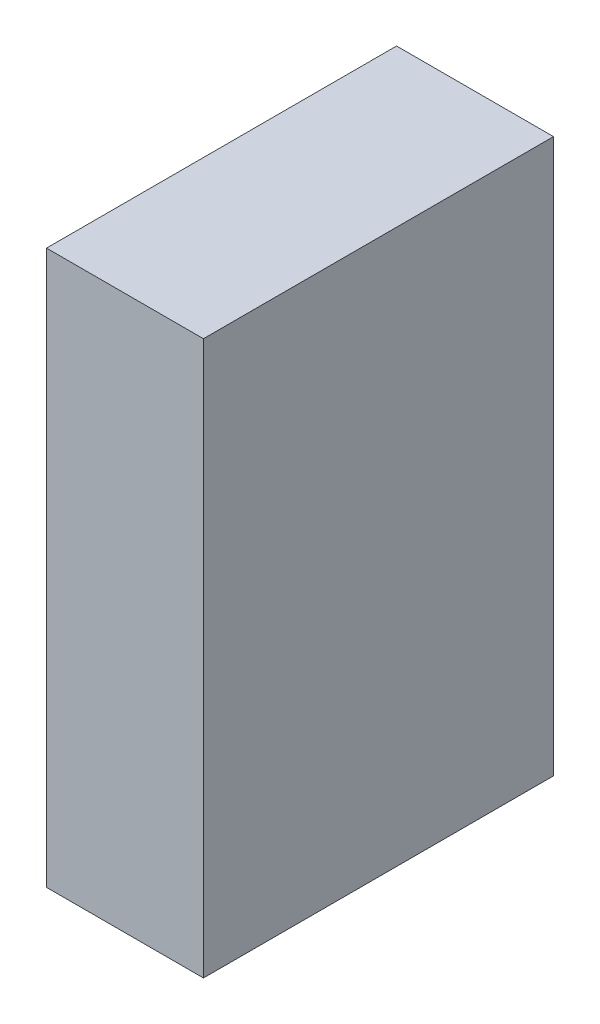
ISO-10303-21;
HEADER;
FILE_DESCRIPTION(('STEP AP214'),'2;1');
FILE_NAME('part.step','',(''),(''),'','','');
FILE_SCHEMA(('AUTOMOTIVE_DESIGN { 1 0 10303 214 1 1 1 1 }'));
ENDSEC;
DATA;
#1=APPLICATION_CONTEXT('core data for automotive mechanical design processes');
#2=APPLICATION_PROTOCOL_DEFINITION('international standard','automotive_design',2000,#1);
#3=PRODUCT_CONTEXT('',#1,'mechanical');
#4=PRODUCT('Part','Part','',(#3));
#5=PRODUCT_RELATED_PRODUCT_CATEGORY('part','',(#4));
#6=PRODUCT_DEFINITION_FORMATION('','',#4);
#7=PRODUCT_DEFINITION_CONTEXT('part definition',#1,'design');
#8=PRODUCT_DEFINITION('design','',#6,#7);
#9=PRODUCT_DEFINITION_SHAPE('','',#8);
#10=(LENGTH_UNIT() NAMED_UNIT(*) SI_UNIT(.MILLI.,.METRE.));
#11=(NAMED_UNIT(*) PLANE_ANGLE_UNIT() SI_UNIT($,.RADIAN.));
#12=(NAMED_UNIT(*) SI_UNIT($,.STERADIAN.) SOLID_ANGLE_UNIT());
#13=UNCERTAINTY_MEASURE_WITH_UNIT(LENGTH_MEASURE(1.E-05),#10,'distance_accuracy_value','');
#14=(GEOMETRIC_REPRESENTATION_CONTEXT(3) GLOBAL_UNCERTAINTY_ASSIGNED_CONTEXT((#13)) GLOBAL_UNIT_ASSIGNED_CONTEXT((#10,
#11,#12)) REPRESENTATION_CONTEXT('',''));
#15=CARTESIAN_POINT('',(0.,0.,0.));
#16=DIRECTION('',(0.,0.,1.));
#17=DIRECTION('',(1.,0.,0.));
#18=AXIS2_PLACEMENT_3D('',#15,#16,#17);
#19=CARTESIAN_POINT('',(-0.13449046,-0.47448978,0.));
#20=DIRECTION('',(-1.,0.,0.));
#21=DIRECTION('',(0.,0.,1.));
#22=AXIS2_PLACEMENT_3D('',#19,#20,#21);
#23=PLANE('',#22);
#24=DIRECTION('',(0.,0.,1.));
#25=VECTOR('',#24,1.);
#26=CARTESIAN_POINT('',(-0.13449046,0.47449232,0.));
#27=LINE('',#26,#25);
#28=CARTESIAN_POINT('',(-0.13449046,0.47449232,0.));
#29=VERTEX_POINT('',#28);
#30=CARTESIAN_POINT('',(-0.13449046,0.47449232,0.5999988));
#31=VERTEX_POINT('',#30);
#32=EDGE_CURVE('E20',#29,#31,#27,.T.);
#33=ORIENTED_EDGE('',*,*,#32,.F.);
#34=DIRECTION('',(0.,1.,0.));
#35=VECTOR('',#34,1.);
#36=CARTESIAN_POINT('',(-0.13449046,0.47449232,0.));
#37=LINE('',#36,#35);
#38=CARTESIAN_POINT('',(-0.13449046,-0.47448978,0.));
#39=VERTEX_POINT('',#38);
#40=EDGE_CURVE('E80',#29,#39,#37,.F.);
#41=ORIENTED_EDGE('',*,*,#40,.T.);
#42=DIRECTION('',(0.,0.,-1.));
#43=VECTOR('',#42,1.);
#44=CARTESIAN_POINT('',(-0.13449046,-0.47448978,0.));
#45=LINE('',#44,#43);
#46=CARTESIAN_POINT('',(-0.13449046,-0.47448978,0.5999988));
#47=VERTEX_POINT('',#46);
#48=EDGE_CURVE('E68',#47,#39,#45,.T.);
#49=ORIENTED_EDGE('',*,*,#48,.F.);
#50=DIRECTION('',(0.,1.,0.));
#51=VECTOR('',#50,1.);
#52=CARTESIAN_POINT('',(-0.13449046,0.47449232,0.5999988));
#53=LINE('',#52,#51);
#54=EDGE_CURVE('E56',#31,#47,#53,.F.);
#55=ORIENTED_EDGE('',*,*,#54,.F.);
#56=EDGE_LOOP('',(#33,#41,#49,#55));
#57=FACE_BOUND('',#56,.T.);
#58=ADVANCED_FACE('F17',(#57),#23,.T.);
#59=CARTESIAN_POINT('',(-0.13449046,0.47449232,0.));
#60=DIRECTION('',(0.,1.,0.));
#61=DIRECTION('',(0.,0.,1.));
#62=AXIS2_PLACEMENT_3D('',#59,#60,#61);
#63=PLANE('',#62);
#64=DIRECTION('',(0.,0.,-1.));
#65=VECTOR('',#64,1.);
#66=CARTESIAN_POINT('',(0.134493,0.47449232,0.));
#67=LINE('',#66,#65);
#68=CARTESIAN_POINT('',(0.134493,0.47449232,0.));
#69=VERTEX_POINT('',#68);
#70=CARTESIAN_POINT('',(0.134493,0.47449232,0.5999988));
#71=VERTEX_POINT('',#70);
#72=EDGE_CURVE('E83',#69,#71,#67,.F.);
#73=ORIENTED_EDGE('',*,*,#72,.F.);
#74=DIRECTION('',(1.,0.,0.));
#75=VECTOR('',#74,1.);
#76=CARTESIAN_POINT('',(0.134493,0.47449232,0.));
#77=LINE('',#76,#75);
#78=EDGE_CURVE('E65',#69,#29,#77,.F.);
#79=ORIENTED_EDGE('',*,*,#78,.T.);
#80=ORIENTED_EDGE('',*,*,#32,.T.);
#81=DIRECTION('',(1.,0.,0.));
#82=VECTOR('',#81,1.);
#83=CARTESIAN_POINT('',(0.134493,0.47449232,0.5999988));
#84=LINE('',#83,#82);
#85=EDGE_CURVE('E62',#71,#31,#84,.F.);
#86=ORIENTED_EDGE('',*,*,#85,.F.);
#87=EDGE_LOOP('',(#73,#79,#80,#86));
#88=FACE_BOUND('',#87,.T.);
#89=ADVANCED_FACE('F61',(#88),#63,.T.);
#90=CARTESIAN_POINT('',(0.134493,0.47449232,0.5999988));
#91=DIRECTION('',(0.,0.,1.));
#92=DIRECTION('',(1.,0.,0.));
#93=AXIS2_PLACEMENT_3D('',#90,#91,#92);
#94=PLANE('',#93);
#95=DIRECTION('',(1.,0.,0.));
#96=VECTOR('',#95,1.);
#97=CARTESIAN_POINT('',(0.134493,-0.47448978,0.5999988));
#98=LINE('',#97,#96);
#99=CARTESIAN_POINT('',(0.134493,-0.47448978,0.5999988));
#100=VERTEX_POINT('',#99);
#101=EDGE_CURVE('E70',#100,#47,#98,.F.);
#102=ORIENTED_EDGE('',*,*,#101,.F.);
#103=DIRECTION('',(0.,1.,0.));
#104=VECTOR('',#103,1.);
#105=CARTESIAN_POINT('',(0.134493,0.47449232,0.5999988));
#106=LINE('',#105,#104);
#107=EDGE_CURVE('E74',#71,#100,#106,.F.);
#108=ORIENTED_EDGE('',*,*,#107,.F.);
#109=ORIENTED_EDGE('',*,*,#85,.T.);
#110=ORIENTED_EDGE('',*,*,#54,.T.);
#111=EDGE_LOOP('',(#102,#108,#109,#110));
#112=FACE_BOUND('',#111,.T.);
#113=ADVANCED_FACE('F72',(#112),#94,.T.);
#114=CARTESIAN_POINT('',(0.134493,-0.47448978,0.));
#115=DIRECTION('',(0.,-1.,0.));
#116=DIRECTION('',(0.,0.,-1.));
#117=AXIS2_PLACEMENT_3D('',#114,#115,#116);
#118=PLANE('',#117);
#119=ORIENTED_EDGE('',*,*,#48,.T.);
#120=DIRECTION('',(1.,0.,0.));
#121=VECTOR('',#120,1.);
#122=CARTESIAN_POINT('',(0.134493,-0.47448978,0.));
#123=LINE('',#122,#121);
#124=CARTESIAN_POINT('',(0.134493,-0.47448978,0.));
#125=VERTEX_POINT('',#124);
#126=EDGE_CURVE('E35',#39,#125,#123,.T.);
#127=ORIENTED_EDGE('',*,*,#126,.T.);
#128=DIRECTION('',(0.,0.,-1.));
#129=VECTOR('',#128,1.);
#130=CARTESIAN_POINT('',(0.134493,-0.47448978,0.));
#131=LINE('',#130,#129);
#132=EDGE_CURVE('E26',#100,#125,#131,.T.);
#133=ORIENTED_EDGE('',*,*,#132,.F.);
#134=ORIENTED_EDGE('',*,*,#101,.T.);
#135=EDGE_LOOP('',(#119,#127,#133,#134));
#136=FACE_BOUND('',#135,.T.);
#137=ADVANCED_FACE('F89',(#136),#118,.T.);
#138=CARTESIAN_POINT('',(0.134493,0.47449232,0.));
#139=DIRECTION('',(0.,0.,1.));
#140=DIRECTION('',(1.,0.,0.));
#141=AXIS2_PLACEMENT_3D('',#138,#139,#140);
#142=PLANE('',#141);
#143=ORIENTED_EDGE('',*,*,#126,.F.);
#144=ORIENTED_EDGE('',*,*,#40,.F.);
#145=ORIENTED_EDGE('',*,*,#78,.F.);
#146=DIRECTION('',(0.,1.,0.));
#147=VECTOR('',#146,1.);
#148=CARTESIAN_POINT('',(0.134493,0.47449232,0.));
#149=LINE('',#148,#147);
#150=EDGE_CURVE('E11',#125,#69,#149,.T.);
#151=ORIENTED_EDGE('',*,*,#150,.F.);
#152=EDGE_LOOP('',(#143,#144,#145,#151));
#153=FACE_BOUND('',#152,.T.);
#154=ADVANCED_FACE('F91',(#153),#142,.F.);
#155=CARTESIAN_POINT('',(0.134493,0.47449232,0.));
#156=DIRECTION('',(1.,0.,0.));
#157=DIRECTION('',(0.,0.,-1.));
#158=AXIS2_PLACEMENT_3D('',#155,#156,#157);
#159=PLANE('',#158);
#160=ORIENTED_EDGE('',*,*,#132,.T.);
#161=ORIENTED_EDGE('',*,*,#150,.T.);
#162=ORIENTED_EDGE('',*,*,#72,.T.);
#163=ORIENTED_EDGE('',*,*,#107,.T.);
#164=EDGE_LOOP('',(#160,#161,#162,#163));
#165=FACE_BOUND('',#164,.T.);
#166=ADVANCED_FACE('F88',(#165),#159,.T.);
#167=CLOSED_SHELL('',(#58,#89,#113,#137,#154,#166));
#168=MANIFOLD_SOLID_BREP('B1',#167);
#169=ADVANCED_BREP_SHAPE_REPRESENTATION('',(#18,#168),#14);
#170=SHAPE_DEFINITION_REPRESENTATION(#9,#169);
ENDSEC;
END-ISO-10303-21;
